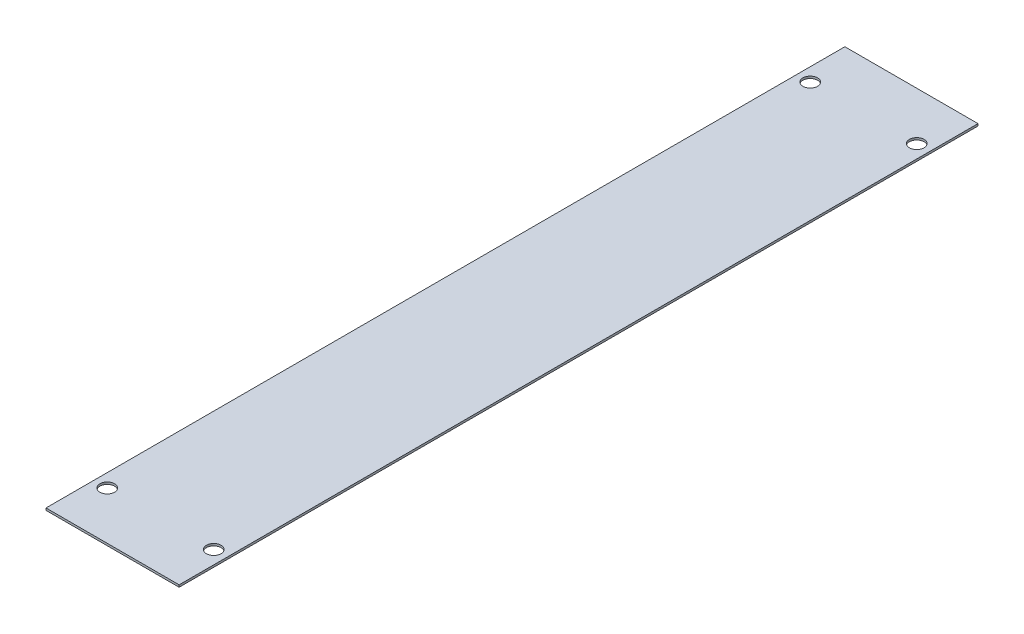
ISO-10303-21;
HEADER;
FILE_DESCRIPTION(('STEP AP214'),'2;1');
FILE_NAME('part.step','',(''),(''),'','','');
FILE_SCHEMA(('AUTOMOTIVE_DESIGN { 1 0 10303 214 1 1 1 1 }'));
ENDSEC;
DATA;
#1=APPLICATION_CONTEXT('core data for automotive mechanical design processes');
#2=APPLICATION_PROTOCOL_DEFINITION('international standard','automotive_design',2000,#1);
#3=PRODUCT_CONTEXT('',#1,'mechanical');
#4=PRODUCT('Part','Part','',(#3));
#5=PRODUCT_RELATED_PRODUCT_CATEGORY('part','',(#4));
#6=PRODUCT_DEFINITION_FORMATION('','',#4);
#7=PRODUCT_DEFINITION_CONTEXT('part definition',#1,'design');
#8=PRODUCT_DEFINITION('design','',#6,#7);
#9=PRODUCT_DEFINITION_SHAPE('','',#8);
#10=(LENGTH_UNIT() NAMED_UNIT(*) SI_UNIT(.MILLI.,.METRE.));
#11=(NAMED_UNIT(*) PLANE_ANGLE_UNIT() SI_UNIT($,.RADIAN.));
#12=(NAMED_UNIT(*) SI_UNIT($,.STERADIAN.) SOLID_ANGLE_UNIT());
#13=UNCERTAINTY_MEASURE_WITH_UNIT(LENGTH_MEASURE(1.E-05),#10,'distance_accuracy_value','');
#14=(GEOMETRIC_REPRESENTATION_CONTEXT(3) GLOBAL_UNCERTAINTY_ASSIGNED_CONTEXT((#13)) GLOBAL_UNIT_ASSIGNED_CONTEXT((#10,
#11,#12)) REPRESENTATION_CONTEXT('',''));
#15=CARTESIAN_POINT('',(0.,0.,0.));
#16=DIRECTION('',(0.,0.,1.));
#17=DIRECTION('',(1.,0.,0.));
#18=AXIS2_PLACEMENT_3D('',#15,#16,#17);
#19=CARTESIAN_POINT('',(-12.5,0.4,75.));
#20=DIRECTION('',(1.,0.,0.));
#21=DIRECTION('',(0.,0.,-1.));
#22=AXIS2_PLACEMENT_3D('',#19,#20,#21);
#23=PLANE('',#22);
#24=DIRECTION('',(0.,0.,1.));
#25=VECTOR('',#24,1.);
#26=CARTESIAN_POINT('',(-12.5,0.,75.));
#27=LINE('',#26,#25);
#28=CARTESIAN_POINT('',(-12.5,0.,-75.));
#29=VERTEX_POINT('',#28);
#30=CARTESIAN_POINT('',(-12.5,0.,75.));
#31=VERTEX_POINT('',#30);
#32=EDGE_CURVE('E100',#29,#31,#27,.T.);
#33=ORIENTED_EDGE('',*,*,#32,.T.);
#34=DIRECTION('',(0.,-1.,0.));
#35=VECTOR('',#34,1.);
#36=CARTESIAN_POINT('',(-12.5,0.4,75.));
#37=LINE('',#36,#35);
#38=CARTESIAN_POINT('',(-12.5,0.4,75.));
#39=VERTEX_POINT('',#38);
#40=EDGE_CURVE('E11',#39,#31,#37,.T.);
#41=ORIENTED_EDGE('',*,*,#40,.F.);
#42=DIRECTION('',(0.,0.,1.));
#43=VECTOR('',#42,1.);
#44=CARTESIAN_POINT('',(-12.5,0.4,75.));
#45=LINE('',#44,#43);
#46=CARTESIAN_POINT('',(-12.5,0.4,-75.));
#47=VERTEX_POINT('',#46);
#48=EDGE_CURVE('E88',#47,#39,#45,.T.);
#49=ORIENTED_EDGE('',*,*,#48,.F.);
#50=DIRECTION('',(0.,-1.,0.));
#51=VECTOR('',#50,1.);
#52=CARTESIAN_POINT('',(-12.5,0.4,-75.));
#53=LINE('',#52,#51);
#54=EDGE_CURVE('E96',#47,#29,#53,.T.);
#55=ORIENTED_EDGE('',*,*,#54,.T.);
#56=EDGE_LOOP('',(#33,#41,#49,#55));
#57=FACE_BOUND('',#56,.T.);
#58=ADVANCED_FACE('F37',(#57),#23,.F.);
#59=CARTESIAN_POINT('',(12.5,0.4,75.));
#60=DIRECTION('',(0.,0.,-1.));
#61=DIRECTION('',(-1.,0.,0.));
#62=AXIS2_PLACEMENT_3D('',#59,#60,#61);
#63=PLANE('',#62);
#64=DIRECTION('',(1.,0.,0.));
#65=VECTOR('',#64,1.);
#66=CARTESIAN_POINT('',(12.5,0.,75.));
#67=LINE('',#66,#65);
#68=CARTESIAN_POINT('',(12.5,0.,75.));
#69=VERTEX_POINT('',#68);
#70=EDGE_CURVE('E92',#31,#69,#67,.T.);
#71=ORIENTED_EDGE('',*,*,#70,.T.);
#72=DIRECTION('',(0.,-1.,0.));
#73=VECTOR('',#72,1.);
#74=CARTESIAN_POINT('',(12.5,0.4,75.));
#75=LINE('',#74,#73);
#76=CARTESIAN_POINT('',(12.5,0.4,75.));
#77=VERTEX_POINT('',#76);
#78=EDGE_CURVE('E45',#77,#69,#75,.T.);
#79=ORIENTED_EDGE('',*,*,#78,.F.);
#80=DIRECTION('',(1.,0.,0.));
#81=VECTOR('',#80,1.);
#82=CARTESIAN_POINT('',(12.5,0.4,75.));
#83=LINE('',#82,#81);
#84=EDGE_CURVE('E83',#39,#77,#83,.T.);
#85=ORIENTED_EDGE('',*,*,#84,.F.);
#86=ORIENTED_EDGE('',*,*,#40,.T.);
#87=EDGE_LOOP('',(#71,#79,#85,#86));
#88=FACE_BOUND('',#87,.T.);
#89=ADVANCED_FACE('F91',(#88),#63,.F.);
#90=CARTESIAN_POINT('',(12.5,0.4,75.));
#91=DIRECTION('',(-1.,0.,0.));
#92=DIRECTION('',(0.,0.,1.));
#93=AXIS2_PLACEMENT_3D('',#90,#91,#92);
#94=PLANE('',#93);
#95=DIRECTION('',(0.,0.,-1.));
#96=VECTOR('',#95,1.);
#97=CARTESIAN_POINT('',(12.5,0.,75.));
#98=LINE('',#97,#96);
#99=CARTESIAN_POINT('',(12.5,0.,-75.));
#100=VERTEX_POINT('',#99);
#101=EDGE_CURVE('E70',#69,#100,#98,.T.);
#102=ORIENTED_EDGE('',*,*,#101,.T.);
#103=DIRECTION('',(0.,-1.,0.));
#104=VECTOR('',#103,1.);
#105=CARTESIAN_POINT('',(12.5,0.4,-75.));
#106=LINE('',#105,#104);
#107=CARTESIAN_POINT('',(12.5,0.4,-75.));
#108=VERTEX_POINT('',#107);
#109=EDGE_CURVE('E93',#108,#100,#106,.T.);
#110=ORIENTED_EDGE('',*,*,#109,.F.);
#111=DIRECTION('',(0.,0.,-1.));
#112=VECTOR('',#111,1.);
#113=CARTESIAN_POINT('',(12.5,0.4,75.));
#114=LINE('',#113,#112);
#115=EDGE_CURVE('E86',#77,#108,#114,.T.);
#116=ORIENTED_EDGE('',*,*,#115,.F.);
#117=ORIENTED_EDGE('',*,*,#78,.T.);
#118=EDGE_LOOP('',(#102,#110,#116,#117));
#119=FACE_BOUND('',#118,.T.);
#120=ADVANCED_FACE('F94',(#119),#94,.F.);
#121=CARTESIAN_POINT('',(12.5,0.4,-75.));
#122=DIRECTION('',(0.,0.,1.));
#123=DIRECTION('',(1.,0.,0.));
#124=AXIS2_PLACEMENT_3D('',#121,#122,#123);
#125=PLANE('',#124);
#126=DIRECTION('',(-1.,0.,0.));
#127=VECTOR('',#126,1.);
#128=CARTESIAN_POINT('',(12.5,0.,-75.));
#129=LINE('',#128,#127);
#130=EDGE_CURVE('E76',#100,#29,#129,.T.);
#131=ORIENTED_EDGE('',*,*,#130,.T.);
#132=ORIENTED_EDGE('',*,*,#54,.F.);
#133=DIRECTION('',(-1.,0.,0.));
#134=VECTOR('',#133,1.);
#135=CARTESIAN_POINT('',(12.5,0.4,-75.));
#136=LINE('',#135,#134);
#137=EDGE_CURVE('E53',#108,#47,#136,.T.);
#138=ORIENTED_EDGE('',*,*,#137,.F.);
#139=ORIENTED_EDGE('',*,*,#109,.T.);
#140=EDGE_LOOP('',(#131,#132,#138,#139));
#141=FACE_BOUND('',#140,.T.);
#142=ADVANCED_FACE('F108',(#141),#125,.F.);
#143=CARTESIAN_POINT('',(0.,0.4,0.));
#144=DIRECTION('',(0.,1.,0.));
#145=DIRECTION('',(0.,0.,1.));
#146=AXIS2_PLACEMENT_3D('',#143,#144,#145);
#147=PLANE('',#146);
#148=CARTESIAN_POINT('',(10.,0.4,66.0000000000001));
#149=DIRECTION('',(0.,1.,0.));
#150=DIRECTION('',(0.,0.,-1.));
#151=AXIS2_PLACEMENT_3D('',#148,#149,#150);
#152=CIRCLE('',#151,1.37999999999999);
#153=CARTESIAN_POINT('',(10.,0.4,64.6200000000001));
#154=VERTEX_POINT('',#153);
#155=EDGE_CURVE('E132',#154,#154,#152,.T.);
#156=ORIENTED_EDGE('',*,*,#155,.F.);
#157=EDGE_LOOP('',(#156));
#158=FACE_BOUND('',#157,.T.);
#159=CARTESIAN_POINT('',(-10.,0.4,66.0000000000001));
#160=DIRECTION('',(0.,-1.,0.));
#161=DIRECTION('',(0.,0.,-1.));
#162=AXIS2_PLACEMENT_3D('',#159,#160,#161);
#163=CIRCLE('',#162,1.37999999999999);
#164=CARTESIAN_POINT('',(-10.,0.4,64.6200000000001));
#165=VERTEX_POINT('',#164);
#166=EDGE_CURVE('E126',#165,#165,#163,.T.);
#167=ORIENTED_EDGE('',*,*,#166,.T.);
#168=EDGE_LOOP('',(#167));
#169=FACE_BOUND('',#168,.T.);
#170=CARTESIAN_POINT('',(10.,0.4,-66.0000000000001));
#171=DIRECTION('',(0.,-1.,0.));
#172=DIRECTION('',(0.,0.,1.));
#173=AXIS2_PLACEMENT_3D('',#170,#171,#172);
#174=CIRCLE('',#173,1.37999999999999);
#175=CARTESIAN_POINT('',(10.,0.4,-64.6200000000001));
#176=VERTEX_POINT('',#175);
#177=EDGE_CURVE('E120',#176,#176,#174,.T.);
#178=ORIENTED_EDGE('',*,*,#177,.T.);
#179=EDGE_LOOP('',(#178));
#180=FACE_BOUND('',#179,.T.);
#181=CARTESIAN_POINT('',(-10.,0.4,-66.0000000000001));
#182=DIRECTION('',(0.,1.,0.));
#183=DIRECTION('',(0.,0.,1.));
#184=AXIS2_PLACEMENT_3D('',#181,#182,#183);
#185=CIRCLE('',#184,1.37999999999999);
#186=CARTESIAN_POINT('',(-10.,0.4,-64.6200000000001));
#187=VERTEX_POINT('',#186);
#188=EDGE_CURVE('E114',#187,#187,#185,.T.);
#189=ORIENTED_EDGE('',*,*,#188,.F.);
#190=EDGE_LOOP('',(#189));
#191=FACE_BOUND('',#190,.T.);
#192=ORIENTED_EDGE('',*,*,#48,.T.);
#193=ORIENTED_EDGE('',*,*,#84,.T.);
#194=ORIENTED_EDGE('',*,*,#115,.T.);
#195=ORIENTED_EDGE('',*,*,#137,.T.);
#196=EDGE_LOOP('',(#192,#193,#194,#195));
#197=FACE_BOUND('',#196,.T.);
#198=ADVANCED_FACE('F84',(#158,#169,#180,#191,#197),#147,.T.);
#199=CARTESIAN_POINT('',(0.,0.,0.));
#200=DIRECTION('',(0.,1.,0.));
#201=DIRECTION('',(0.,0.,1.));
#202=AXIS2_PLACEMENT_3D('',#199,#200,#201);
#203=PLANE('',#202);
#204=CARTESIAN_POINT('',(10.,0.,66.0000000000001));
#205=DIRECTION('',(0.,1.,0.));
#206=DIRECTION('',(0.,0.,-1.));
#207=AXIS2_PLACEMENT_3D('',#204,#205,#206);
#208=CIRCLE('',#207,1.37999999999999);
#209=CARTESIAN_POINT('',(10.,0.,64.6200000000001));
#210=VERTEX_POINT('',#209);
#211=EDGE_CURVE('E129',#210,#210,#208,.T.);
#212=ORIENTED_EDGE('',*,*,#211,.T.);
#213=EDGE_LOOP('',(#212));
#214=FACE_BOUND('',#213,.T.);
#215=CARTESIAN_POINT('',(-10.,0.,66.0000000000001));
#216=DIRECTION('',(0.,-1.,0.));
#217=DIRECTION('',(0.,0.,-1.));
#218=AXIS2_PLACEMENT_3D('',#215,#216,#217);
#219=CIRCLE('',#218,1.37999999999999);
#220=CARTESIAN_POINT('',(-10.,0.,64.6200000000001));
#221=VERTEX_POINT('',#220);
#222=EDGE_CURVE('E123',#221,#221,#219,.T.);
#223=ORIENTED_EDGE('',*,*,#222,.F.);
#224=EDGE_LOOP('',(#223));
#225=FACE_BOUND('',#224,.T.);
#226=CARTESIAN_POINT('',(10.,0.,-66.0000000000001));
#227=DIRECTION('',(0.,-1.,0.));
#228=DIRECTION('',(0.,0.,1.));
#229=AXIS2_PLACEMENT_3D('',#226,#227,#228);
#230=CIRCLE('',#229,1.37999999999999);
#231=CARTESIAN_POINT('',(10.,0.,-64.6200000000001));
#232=VERTEX_POINT('',#231);
#233=EDGE_CURVE('E117',#232,#232,#230,.T.);
#234=ORIENTED_EDGE('',*,*,#233,.F.);
#235=EDGE_LOOP('',(#234));
#236=FACE_BOUND('',#235,.T.);
#237=CARTESIAN_POINT('',(-10.,0.,-66.0000000000001));
#238=DIRECTION('',(0.,1.,0.));
#239=DIRECTION('',(0.,0.,1.));
#240=AXIS2_PLACEMENT_3D('',#237,#238,#239);
#241=CIRCLE('',#240,1.37999999999999);
#242=CARTESIAN_POINT('',(-10.,0.,-64.6200000000001));
#243=VERTEX_POINT('',#242);
#244=EDGE_CURVE('E103',#243,#243,#241,.T.);
#245=ORIENTED_EDGE('',*,*,#244,.T.);
#246=EDGE_LOOP('',(#245));
#247=FACE_BOUND('',#246,.T.);
#248=ORIENTED_EDGE('',*,*,#32,.F.);
#249=ORIENTED_EDGE('',*,*,#130,.F.);
#250=ORIENTED_EDGE('',*,*,#101,.F.);
#251=ORIENTED_EDGE('',*,*,#70,.F.);
#252=EDGE_LOOP('',(#248,#249,#250,#251));
#253=FACE_BOUND('',#252,.T.);
#254=ADVANCED_FACE('F111',(#214,#225,#236,#247,#253),#203,.F.);
#255=CARTESIAN_POINT('',(-10.,0.,-66.0000000000001));
#256=DIRECTION('',(0.,1.,0.));
#257=DIRECTION('',(0.,0.,1.));
#258=AXIS2_PLACEMENT_3D('',#255,#256,#257);
#259=CYLINDRICAL_SURFACE('',#258,1.37999999999999);
#260=ORIENTED_EDGE('',*,*,#244,.F.);
#261=EDGE_LOOP('',(#260));
#262=FACE_BOUND('',#261,.T.);
#263=ORIENTED_EDGE('',*,*,#188,.T.);
#264=EDGE_LOOP('',(#263));
#265=FACE_BOUND('',#264,.T.);
#266=ADVANCED_FACE('F156',(#262,#265),#259,.F.);
#267=CARTESIAN_POINT('',(10.,0.,-66.0000000000001));
#268=DIRECTION('',(0.,1.,0.));
#269=DIRECTION('',(0.,0.,1.));
#270=AXIS2_PLACEMENT_3D('',#267,#268,#269);
#271=CYLINDRICAL_SURFACE('',#270,1.37999999999999);
#272=ORIENTED_EDGE('',*,*,#233,.T.);
#273=EDGE_LOOP('',(#272));
#274=FACE_BOUND('',#273,.T.);
#275=ORIENTED_EDGE('',*,*,#177,.F.);
#276=EDGE_LOOP('',(#275));
#277=FACE_BOUND('',#276,.T.);
#278=ADVANCED_FACE('F158',(#274,#277),#271,.F.);
#279=CARTESIAN_POINT('',(-10.,0.,66.0000000000001));
#280=DIRECTION('',(0.,1.,0.));
#281=DIRECTION('',(0.,0.,1.));
#282=AXIS2_PLACEMENT_3D('',#279,#280,#281);
#283=CYLINDRICAL_SURFACE('',#282,1.37999999999999);
#284=ORIENTED_EDGE('',*,*,#222,.T.);
#285=EDGE_LOOP('',(#284));
#286=FACE_BOUND('',#285,.T.);
#287=ORIENTED_EDGE('',*,*,#166,.F.);
#288=EDGE_LOOP('',(#287));
#289=FACE_BOUND('',#288,.T.);
#290=ADVANCED_FACE('F143',(#286,#289),#283,.F.);
#291=CARTESIAN_POINT('',(10.,0.,66.0000000000001));
#292=DIRECTION('',(0.,1.,0.));
#293=DIRECTION('',(0.,0.,1.));
#294=AXIS2_PLACEMENT_3D('',#291,#292,#293);
#295=CYLINDRICAL_SURFACE('',#294,1.37999999999999);
#296=ORIENTED_EDGE('',*,*,#211,.F.);
#297=EDGE_LOOP('',(#296));
#298=FACE_BOUND('',#297,.T.);
#299=ORIENTED_EDGE('',*,*,#155,.T.);
#300=EDGE_LOOP('',(#299));
#301=FACE_BOUND('',#300,.T.);
#302=ADVANCED_FACE('F140',(#298,#301),#295,.F.);
#303=CLOSED_SHELL('',(#58,#89,#120,#142,#198,#254,#266,#278,#290,#302));
#304=MANIFOLD_SOLID_BREP('B2',#303);
#305=ADVANCED_BREP_SHAPE_REPRESENTATION('',(#18,#304),#14);
#306=SHAPE_DEFINITION_REPRESENTATION(#9,#305);
ENDSEC;
END-ISO-10303-21;
